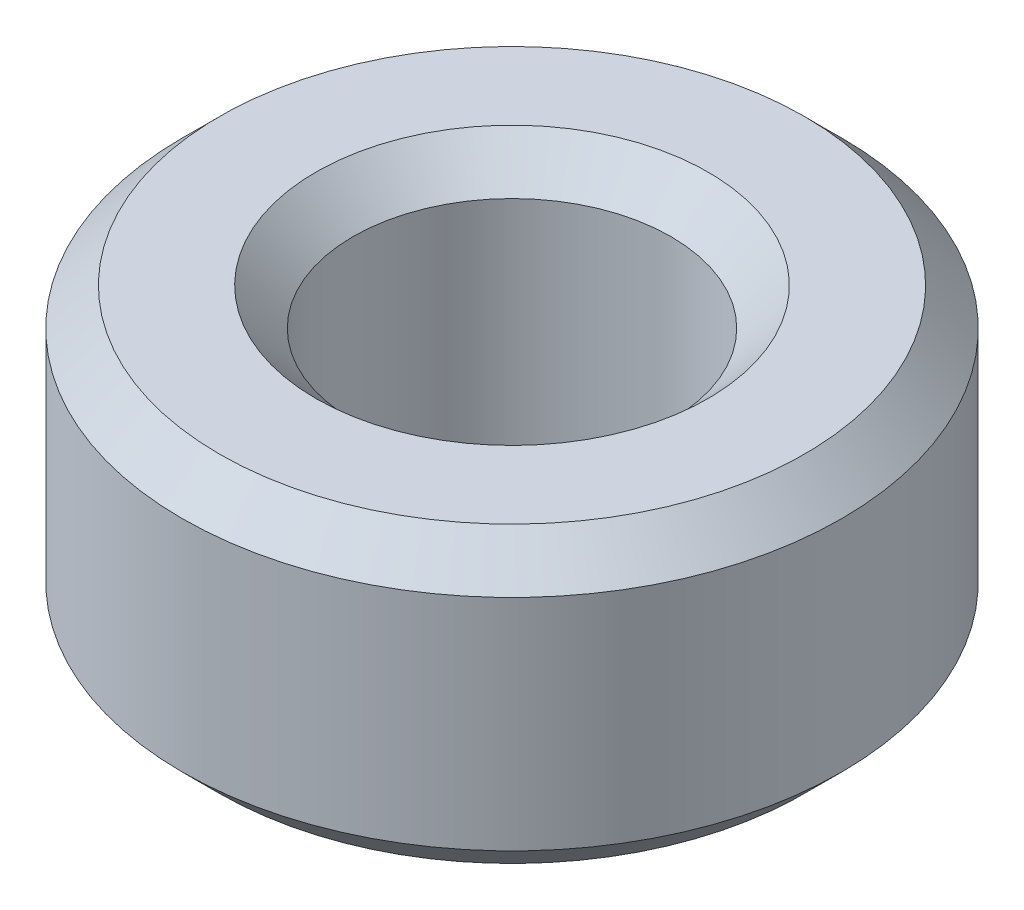
ISO-10303-21;
HEADER;
FILE_DESCRIPTION(('STEP AP214'),'2;1');
FILE_NAME('part.step','',(''),(''),'','','');
FILE_SCHEMA(('AUTOMOTIVE_DESIGN { 1 0 10303 214 1 1 1 1 }'));
ENDSEC;
DATA;
#1=APPLICATION_CONTEXT('core data for automotive mechanical design processes');
#2=APPLICATION_PROTOCOL_DEFINITION('international standard','automotive_design',2000,#1);
#3=PRODUCT_CONTEXT('',#1,'mechanical');
#4=PRODUCT('Part','Part','',(#3));
#5=PRODUCT_RELATED_PRODUCT_CATEGORY('part','',(#4));
#6=PRODUCT_DEFINITION_FORMATION('','',#4);
#7=PRODUCT_DEFINITION_CONTEXT('part definition',#1,'design');
#8=PRODUCT_DEFINITION('design','',#6,#7);
#9=PRODUCT_DEFINITION_SHAPE('','',#8);
#10=(LENGTH_UNIT() NAMED_UNIT(*) SI_UNIT(.MILLI.,.METRE.));
#11=(NAMED_UNIT(*) PLANE_ANGLE_UNIT() SI_UNIT($,.RADIAN.));
#12=(NAMED_UNIT(*) SI_UNIT($,.STERADIAN.) SOLID_ANGLE_UNIT());
#13=UNCERTAINTY_MEASURE_WITH_UNIT(LENGTH_MEASURE(1.E-05),#10,'distance_accuracy_value','');
#14=(GEOMETRIC_REPRESENTATION_CONTEXT(3) GLOBAL_UNCERTAINTY_ASSIGNED_CONTEXT((#13)) GLOBAL_UNIT_ASSIGNED_CONTEXT((#10,
#11,#12)) REPRESENTATION_CONTEXT('',''));
#15=CARTESIAN_POINT('',(0.,0.,0.));
#16=DIRECTION('',(0.,0.,1.));
#17=DIRECTION('',(1.,0.,0.));
#18=AXIS2_PLACEMENT_3D('',#15,#16,#17);
#19=CARTESIAN_POINT('',(0.,11.1428797313058,0.));
#20=DIRECTION('',(0.,-1.,0.));
#21=DIRECTION('',(0.,0.,-1.));
#22=AXIS2_PLACEMENT_3D('',#19,#20,#21);
#23=CYLINDRICAL_SURFACE('',#22,12.5);
#24=CARTESIAN_POINT('',(0.,1.41108639919822,0.));
#25=DIRECTION('',(0.,1.,0.));
#26=DIRECTION('',(0.,0.,1.));
#27=AXIS2_PLACEMENT_3D('',#24,#25,#26);
#28=CIRCLE('',#27,12.5);
#29=CARTESIAN_POINT('',(0.,1.41108639919822,12.5));
#30=VERTEX_POINT('',#29);
#31=EDGE_CURVE('E10',#30,#30,#28,.T.);
#32=ORIENTED_EDGE('',*,*,#31,.T.);
#33=EDGE_LOOP('',(#32));
#34=FACE_BOUND('',#33,.T.);
#35=CARTESIAN_POINT('',(0.,9.73179333210758,0.));
#36=DIRECTION('',(0.,1.,0.));
#37=DIRECTION('',(0.,0.,1.));
#38=AXIS2_PLACEMENT_3D('',#35,#36,#37);
#39=CIRCLE('',#38,12.5);
#40=CARTESIAN_POINT('',(0.,9.73179333210758,12.5));
#41=VERTEX_POINT('',#40);
#42=EDGE_CURVE('E50',#41,#41,#39,.F.);
#43=ORIENTED_EDGE('',*,*,#42,.T.);
#44=EDGE_LOOP('',(#43));
#45=FACE_BOUND('',#44,.T.);
#46=ADVANCED_FACE('F39',(#34,#45),#23,.T.);
#47=CARTESIAN_POINT('',(0.,11.1428797313058,0.));
#48=DIRECTION('',(0.,1.,0.));
#49=DIRECTION('',(0.,0.,1.));
#50=AXIS2_PLACEMENT_3D('',#47,#48,#49);
#51=PLANE('',#50);
#52=CARTESIAN_POINT('',(0.,11.1428797313058,0.));
#53=DIRECTION('',(0.,1.,0.));
#54=DIRECTION('',(0.,0.,1.));
#55=AXIS2_PLACEMENT_3D('',#52,#53,#54);
#56=CIRCLE('',#55,7.43617921979232);
#57=CARTESIAN_POINT('',(0.,11.1428797313058,7.43617921979232));
#58=VERTEX_POINT('',#57);
#59=EDGE_CURVE('E58',#58,#58,#56,.F.);
#60=ORIENTED_EDGE('',*,*,#59,.T.);
#61=EDGE_LOOP('',(#60));
#62=FACE_BOUND('',#61,.T.);
#63=CARTESIAN_POINT('',(0.,11.1428797313058,0.));
#64=DIRECTION('',(0.,1.,0.));
#65=DIRECTION('',(0.,0.,1.));
#66=AXIS2_PLACEMENT_3D('',#63,#64,#65);
#67=CIRCLE('',#66,11.0889136008018);
#68=CARTESIAN_POINT('',(0.,11.1428797313058,11.0889136008018));
#69=VERTEX_POINT('',#68);
#70=EDGE_CURVE('E61',#69,#69,#67,.T.);
#71=ORIENTED_EDGE('',*,*,#70,.T.);
#72=EDGE_LOOP('',(#71));
#73=FACE_BOUND('',#72,.T.);
#74=ADVANCED_FACE('F88',(#62,#73),#51,.T.);
#75=CARTESIAN_POINT('',(0.,0.,0.));
#76=DIRECTION('',(0.,1.,0.));
#77=DIRECTION('',(0.,0.,1.));
#78=AXIS2_PLACEMENT_3D('',#75,#76,#77);
#79=PLANE('',#78);
#80=CARTESIAN_POINT('',(0.,0.,0.));
#81=DIRECTION('',(0.,1.,0.));
#82=DIRECTION('',(0.,0.,1.));
#83=AXIS2_PLACEMENT_3D('',#80,#81,#82);
#84=CIRCLE('',#83,7.43617921979231);
#85=CARTESIAN_POINT('',(0.,0.,7.43617921979231));
#86=VERTEX_POINT('',#85);
#87=EDGE_CURVE('E51',#86,#86,#84,.T.);
#88=ORIENTED_EDGE('',*,*,#87,.T.);
#89=EDGE_LOOP('',(#88));
#90=FACE_BOUND('',#89,.T.);
#91=CARTESIAN_POINT('',(0.,0.,0.));
#92=DIRECTION('',(0.,1.,0.));
#93=DIRECTION('',(0.,0.,1.));
#94=AXIS2_PLACEMENT_3D('',#91,#92,#93);
#95=CIRCLE('',#94,11.0889136008018);
#96=CARTESIAN_POINT('',(0.,0.,11.0889136008018));
#97=VERTEX_POINT('',#96);
#98=EDGE_CURVE('E54',#97,#97,#95,.F.);
#99=ORIENTED_EDGE('',*,*,#98,.T.);
#100=EDGE_LOOP('',(#99));
#101=FACE_BOUND('',#100,.T.);
#102=ADVANCED_FACE('F83',(#90,#101),#79,.F.);
#103=CARTESIAN_POINT('',(0.,11.1428797313058,0.));
#104=DIRECTION('',(0.,-1.,0.));
#105=DIRECTION('',(0.,0.,-1.));
#106=AXIS2_PLACEMENT_3D('',#103,#104,#105);
#107=CYLINDRICAL_SURFACE('',#106,6.02509282059409);
#108=CARTESIAN_POINT('',(0.,9.73179333210759,0.));
#109=DIRECTION('',(0.,1.,0.));
#110=DIRECTION('',(0.,0.,1.));
#111=AXIS2_PLACEMENT_3D('',#108,#109,#110);
#112=CIRCLE('',#111,6.02509282059409);
#113=CARTESIAN_POINT('',(0.,9.73179333210759,6.02509282059409));
#114=VERTEX_POINT('',#113);
#115=EDGE_CURVE('E67',#114,#114,#112,.T.);
#116=ORIENTED_EDGE('',*,*,#115,.T.);
#117=EDGE_LOOP('',(#116));
#118=FACE_BOUND('',#117,.T.);
#119=CARTESIAN_POINT('',(0.,1.41108639919823,0.));
#120=DIRECTION('',(0.,1.,0.));
#121=DIRECTION('',(0.,0.,1.));
#122=AXIS2_PLACEMENT_3D('',#119,#120,#121);
#123=CIRCLE('',#122,6.02509282059409);
#124=CARTESIAN_POINT('',(0.,1.41108639919823,6.02509282059409));
#125=VERTEX_POINT('',#124);
#126=EDGE_CURVE('E69',#125,#125,#123,.F.);
#127=ORIENTED_EDGE('',*,*,#126,.T.);
#128=EDGE_LOOP('',(#127));
#129=FACE_BOUND('',#128,.T.);
#130=ADVANCED_FACE('F71',(#118,#129),#107,.F.);
#131=CARTESIAN_POINT('',(0.,9.73179333210759,0.));
#132=DIRECTION('',(0.,1.,0.));
#133=DIRECTION('',(0.,0.,1.));
#134=AXIS2_PLACEMENT_3D('',#131,#132,#133);
#135=CONICAL_SURFACE('',#134,6.02509282059409,0.785398163397452);
#136=ORIENTED_EDGE('',*,*,#59,.F.);
#137=EDGE_LOOP('',(#136));
#138=FACE_BOUND('',#137,.T.);
#139=ORIENTED_EDGE('',*,*,#115,.F.);
#140=EDGE_LOOP('',(#139));
#141=FACE_BOUND('',#140,.T.);
#142=ADVANCED_FACE('F77',(#138,#141),#135,.F.);
#143=CARTESIAN_POINT('',(0.,0.,0.));
#144=DIRECTION('',(0.,-1.,0.));
#145=DIRECTION('',(0.,0.,-1.));
#146=AXIS2_PLACEMENT_3D('',#143,#144,#145);
#147=CONICAL_SURFACE('',#146,7.43617921979231,0.785398163397446);
#148=ORIENTED_EDGE('',*,*,#126,.F.);
#149=EDGE_LOOP('',(#148));
#150=FACE_BOUND('',#149,.T.);
#151=ORIENTED_EDGE('',*,*,#87,.F.);
#152=EDGE_LOOP('',(#151));
#153=FACE_BOUND('',#152,.T.);
#154=ADVANCED_FACE('F73',(#150,#153),#147,.F.);
#155=CARTESIAN_POINT('',(0.,1.41108639919822,0.));
#156=DIRECTION('',(0.,1.,0.));
#157=DIRECTION('',(0.,0.,1.));
#158=AXIS2_PLACEMENT_3D('',#155,#156,#157);
#159=CONICAL_SURFACE('',#158,12.5,0.785398163397451);
#160=ORIENTED_EDGE('',*,*,#98,.F.);
#161=EDGE_LOOP('',(#160));
#162=FACE_BOUND('',#161,.T.);
#163=ORIENTED_EDGE('',*,*,#31,.F.);
#164=EDGE_LOOP('',(#163));
#165=FACE_BOUND('',#164,.T.);
#166=ADVANCED_FACE('F76',(#162,#165),#159,.T.);
#167=CARTESIAN_POINT('',(0.,11.1428797313058,0.));
#168=DIRECTION('',(0.,-1.,0.));
#169=DIRECTION('',(0.,0.,-1.));
#170=AXIS2_PLACEMENT_3D('',#167,#168,#169);
#171=CONICAL_SURFACE('',#170,11.0889136008018,0.785398163397446);
#172=ORIENTED_EDGE('',*,*,#42,.F.);
#173=EDGE_LOOP('',(#172));
#174=FACE_BOUND('',#173,.T.);
#175=ORIENTED_EDGE('',*,*,#70,.F.);
#176=EDGE_LOOP('',(#175));
#177=FACE_BOUND('',#176,.T.);
#178=ADVANCED_FACE('F45',(#174,#177),#171,.T.);
#179=CLOSED_SHELL('',(#46,#74,#102,#130,#142,#154,#166,#178));
#180=MANIFOLD_SOLID_BREP('B2',#179);
#181=ADVANCED_BREP_SHAPE_REPRESENTATION('',(#18,#180),#14);
#182=SHAPE_DEFINITION_REPRESENTATION(#9,#181);
ENDSEC;
END-ISO-10303-21;
